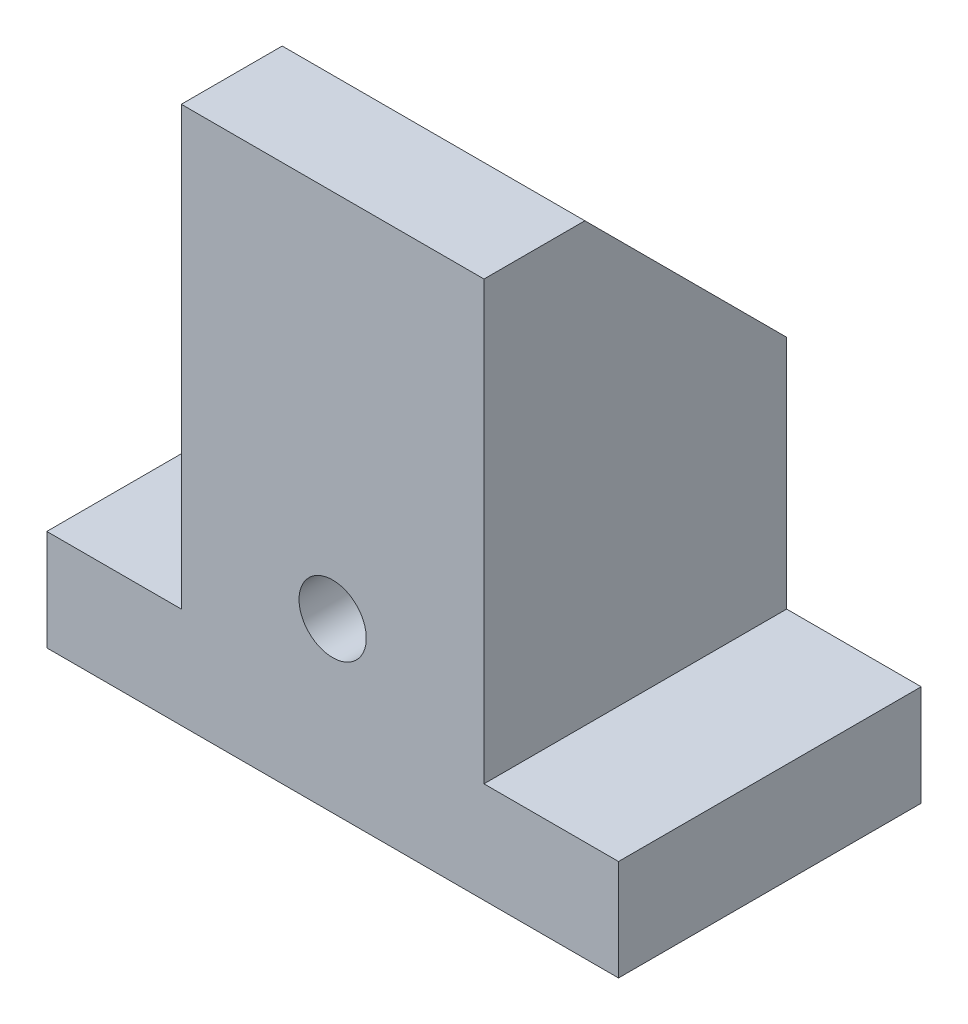
ISO-10303-21;
HEADER;
FILE_DESCRIPTION(('STEP AP214'),'2;1');
FILE_NAME('part.step','',(''),(''),'','','');
FILE_SCHEMA(('AUTOMOTIVE_DESIGN { 1 0 10303 214 1 1 1 1 }'));
ENDSEC;
DATA;
#1=APPLICATION_CONTEXT('core data for automotive mechanical design processes');
#2=APPLICATION_PROTOCOL_DEFINITION('international standard','automotive_design',2000,#1);
#3=PRODUCT_CONTEXT('',#1,'mechanical');
#4=PRODUCT('Part','Part','',(#3));
#5=PRODUCT_RELATED_PRODUCT_CATEGORY('part','',(#4));
#6=PRODUCT_DEFINITION_FORMATION('','',#4);
#7=PRODUCT_DEFINITION_CONTEXT('part definition',#1,'design');
#8=PRODUCT_DEFINITION('design','',#6,#7);
#9=PRODUCT_DEFINITION_SHAPE('','',#8);
#10=(LENGTH_UNIT() NAMED_UNIT(*) SI_UNIT(.MILLI.,.METRE.));
#11=(NAMED_UNIT(*) PLANE_ANGLE_UNIT() SI_UNIT($,.RADIAN.));
#12=(NAMED_UNIT(*) SI_UNIT($,.STERADIAN.) SOLID_ANGLE_UNIT());
#13=UNCERTAINTY_MEASURE_WITH_UNIT(LENGTH_MEASURE(1.E-05),#10,'distance_accuracy_value','');
#14=(GEOMETRIC_REPRESENTATION_CONTEXT(3) GLOBAL_UNCERTAINTY_ASSIGNED_CONTEXT((#13)) GLOBAL_UNIT_ASSIGNED_CONTEXT((#10,
#11,#12)) REPRESENTATION_CONTEXT('',''));
#15=CARTESIAN_POINT('',(0.,0.,0.));
#16=DIRECTION('',(0.,0.,1.));
#17=DIRECTION('',(1.,0.,0.));
#18=AXIS2_PLACEMENT_3D('',#15,#16,#17);
#19=CARTESIAN_POINT('',(0.,16.,0.));
#20=DIRECTION('',(1.,0.,0.));
#21=DIRECTION('',(0.,0.,-1.));
#22=AXIS2_PLACEMENT_3D('',#19,#20,#21);
#23=PLANE('',#22);
#24=DIRECTION('',(0.,-1.,0.));
#25=VECTOR('',#24,1.);
#26=CARTESIAN_POINT('',(0.,16.,-9.));
#27=LINE('',#26,#25);
#28=CARTESIAN_POINT('',(0.,10.,-9.));
#29=VERTEX_POINT('',#28);
#30=CARTESIAN_POINT('',(0.,3.,-9.));
#31=VERTEX_POINT('',#30);
#32=EDGE_CURVE('E211',#29,#31,#27,.T.);
#33=ORIENTED_EDGE('',*,*,#32,.T.);
#34=DIRECTION('',(0.,0.,1.));
#35=VECTOR('',#34,1.);
#36=CARTESIAN_POINT('',(0.,3.,0.));
#37=LINE('',#36,#35);
#38=CARTESIAN_POINT('',(0.,3.,0.));
#39=VERTEX_POINT('',#38);
#40=EDGE_CURVE('E134',#31,#39,#37,.T.);
#41=ORIENTED_EDGE('',*,*,#40,.T.);
#42=DIRECTION('',(0.,-1.,0.));
#43=VECTOR('',#42,1.);
#44=CARTESIAN_POINT('',(0.,16.,0.));
#45=LINE('',#44,#43);
#46=CARTESIAN_POINT('',(0.,16.,0.));
#47=VERTEX_POINT('',#46);
#48=EDGE_CURVE('E145',#47,#39,#45,.T.);
#49=ORIENTED_EDGE('',*,*,#48,.F.);
#50=DIRECTION('',(0.,0.,1.));
#51=VECTOR('',#50,1.);
#52=CARTESIAN_POINT('',(0.,16.,0.));
#53=LINE('',#52,#51);
#54=CARTESIAN_POINT('',(0.,16.,-3.));
#55=VERTEX_POINT('',#54);
#56=EDGE_CURVE('E200',#55,#47,#53,.T.);
#57=ORIENTED_EDGE('',*,*,#56,.F.);
#58=DIRECTION('',(0.,0.707106781186548,0.707106781186548));
#59=VECTOR('',#58,1.);
#60=CARTESIAN_POINT('',(0.,16.,-3.));
#61=LINE('',#60,#59);
#62=EDGE_CURVE('E233',#55,#29,#61,.F.);
#63=ORIENTED_EDGE('',*,*,#62,.T.);
#64=EDGE_LOOP('',(#33,#41,#49,#57,#63));
#65=FACE_BOUND('',#64,.T.);
#66=ADVANCED_FACE('F43',(#65),#23,.F.);
#67=CARTESIAN_POINT('',(0.,16.,0.));
#68=DIRECTION('',(0.,0.,-1.));
#69=DIRECTION('',(-1.,0.,0.));
#70=AXIS2_PLACEMENT_3D('',#67,#68,#69);
#71=PLANE('',#70);
#72=CARTESIAN_POINT('',(4.5,5.,0.));
#73=DIRECTION('',(0.,0.,-1.));
#74=DIRECTION('',(-1.,0.,0.));
#75=AXIS2_PLACEMENT_3D('',#72,#73,#74);
#76=CIRCLE('',#75,1.);
#77=CARTESIAN_POINT('',(3.5,5.,0.));
#78=VERTEX_POINT('',#77);
#79=EDGE_CURVE('E186',#78,#78,#76,.F.);
#80=ORIENTED_EDGE('',*,*,#79,.F.);
#81=EDGE_LOOP('',(#80));
#82=FACE_BOUND('',#81,.T.);
#83=DIRECTION('',(1.,0.,0.));
#84=VECTOR('',#83,1.);
#85=CARTESIAN_POINT('',(0.,0.,0.));
#86=LINE('',#85,#84);
#87=CARTESIAN_POINT('',(-4.00000000000001,0.,0.));
#88=VERTEX_POINT('',#87);
#89=CARTESIAN_POINT('',(13.,0.,0.));
#90=VERTEX_POINT('',#89);
#91=EDGE_CURVE('E195',#88,#90,#86,.T.);
#92=ORIENTED_EDGE('',*,*,#91,.T.);
#93=DIRECTION('',(0.,-1.,0.));
#94=VECTOR('',#93,1.);
#95=CARTESIAN_POINT('',(13.,3.,0.));
#96=LINE('',#95,#94);
#97=CARTESIAN_POINT('',(13.,3.,0.));
#98=VERTEX_POINT('',#97);
#99=EDGE_CURVE('E175',#98,#90,#96,.T.);
#100=ORIENTED_EDGE('',*,*,#99,.F.);
#101=DIRECTION('',(-1.,0.,0.));
#102=VECTOR('',#101,1.);
#103=CARTESIAN_POINT('',(9.,3.,0.));
#104=LINE('',#103,#102);
#105=CARTESIAN_POINT('',(9.,3.,0.));
#106=VERTEX_POINT('',#105);
#107=EDGE_CURVE('E167',#98,#106,#104,.T.);
#108=ORIENTED_EDGE('',*,*,#107,.T.);
#109=DIRECTION('',(0.,-1.,0.));
#110=VECTOR('',#109,1.);
#111=CARTESIAN_POINT('',(9.,16.,0.));
#112=LINE('',#111,#110);
#113=CARTESIAN_POINT('',(9.,16.,0.));
#114=VERTEX_POINT('',#113);
#115=EDGE_CURVE('E223',#114,#106,#112,.T.);
#116=ORIENTED_EDGE('',*,*,#115,.F.);
#117=DIRECTION('',(1.,0.,0.));
#118=VECTOR('',#117,1.);
#119=CARTESIAN_POINT('',(0.,16.,0.));
#120=LINE('',#119,#118);
#121=EDGE_CURVE('E203',#47,#114,#120,.T.);
#122=ORIENTED_EDGE('',*,*,#121,.F.);
#123=ORIENTED_EDGE('',*,*,#48,.T.);
#124=DIRECTION('',(-1.,0.,0.));
#125=VECTOR('',#124,1.);
#126=CARTESIAN_POINT('',(0.,3.,0.));
#127=LINE('',#126,#125);
#128=CARTESIAN_POINT('',(-4.00000000000001,3.,0.));
#129=VERTEX_POINT('',#128);
#130=EDGE_CURVE('E66',#39,#129,#127,.T.);
#131=ORIENTED_EDGE('',*,*,#130,.T.);
#132=DIRECTION('',(0.,-1.,0.));
#133=VECTOR('',#132,1.);
#134=CARTESIAN_POINT('',(-4.00000000000001,3.,0.));
#135=LINE('',#134,#133);
#136=EDGE_CURVE('E125',#129,#88,#135,.T.);
#137=ORIENTED_EDGE('',*,*,#136,.T.);
#138=EDGE_LOOP('',(#92,#100,#108,#116,#122,#123,#131,#137));
#139=FACE_BOUND('',#138,.T.);
#140=ADVANCED_FACE('F142',(#82,#139),#71,.F.);
#141=CARTESIAN_POINT('',(9.,16.,0.));
#142=DIRECTION('',(-1.,0.,0.));
#143=DIRECTION('',(0.,0.,1.));
#144=AXIS2_PLACEMENT_3D('',#141,#142,#143);
#145=PLANE('',#144);
#146=ORIENTED_EDGE('',*,*,#115,.T.);
#147=DIRECTION('',(0.,0.,-1.));
#148=VECTOR('',#147,1.);
#149=CARTESIAN_POINT('',(9.,3.,0.));
#150=LINE('',#149,#148);
#151=CARTESIAN_POINT('',(9.,3.,-9.));
#152=VERTEX_POINT('',#151);
#153=EDGE_CURVE('E158',#106,#152,#150,.T.);
#154=ORIENTED_EDGE('',*,*,#153,.T.);
#155=DIRECTION('',(0.,-1.,0.));
#156=VECTOR('',#155,1.);
#157=CARTESIAN_POINT('',(9.,16.,-9.));
#158=LINE('',#157,#156);
#159=CARTESIAN_POINT('',(9.,10.,-9.));
#160=VERTEX_POINT('',#159);
#161=EDGE_CURVE('E219',#160,#152,#158,.T.);
#162=ORIENTED_EDGE('',*,*,#161,.F.);
#163=DIRECTION('',(0.,-0.707106781186548,-0.707106781186548));
#164=VECTOR('',#163,1.);
#165=CARTESIAN_POINT('',(9.,16.,-3.));
#166=LINE('',#165,#164);
#167=CARTESIAN_POINT('',(9.,16.,-3.));
#168=VERTEX_POINT('',#167);
#169=EDGE_CURVE('E13',#160,#168,#166,.F.);
#170=ORIENTED_EDGE('',*,*,#169,.T.);
#171=DIRECTION('',(0.,0.,-1.));
#172=VECTOR('',#171,1.);
#173=CARTESIAN_POINT('',(9.,16.,0.));
#174=LINE('',#173,#172);
#175=EDGE_CURVE('E207',#114,#168,#174,.T.);
#176=ORIENTED_EDGE('',*,*,#175,.F.);
#177=EDGE_LOOP('',(#146,#154,#162,#170,#176));
#178=FACE_BOUND('',#177,.T.);
#179=ADVANCED_FACE('F269',(#178),#145,.F.);
#180=CARTESIAN_POINT('',(0.,16.,-9.));
#181=DIRECTION('',(0.,0.,1.));
#182=DIRECTION('',(1.,0.,0.));
#183=AXIS2_PLACEMENT_3D('',#180,#181,#182);
#184=PLANE('',#183);
#185=CARTESIAN_POINT('',(4.5,5.,-9.));
#186=DIRECTION('',(0.,0.,-1.));
#187=DIRECTION('',(-1.,0.,0.));
#188=AXIS2_PLACEMENT_3D('',#185,#186,#187);
#189=CIRCLE('',#188,1.);
#190=CARTESIAN_POINT('',(3.5,5.,-9.));
#191=VERTEX_POINT('',#190);
#192=EDGE_CURVE('E179',#191,#191,#189,.T.);
#193=ORIENTED_EDGE('',*,*,#192,.F.);
#194=EDGE_LOOP('',(#193));
#195=FACE_BOUND('',#194,.T.);
#196=ORIENTED_EDGE('',*,*,#32,.F.);
#197=DIRECTION('',(1.,0.,0.));
#198=VECTOR('',#197,1.);
#199=CARTESIAN_POINT('',(0.,10.,-9.));
#200=LINE('',#199,#198);
#201=EDGE_CURVE('E58',#29,#160,#200,.T.);
#202=ORIENTED_EDGE('',*,*,#201,.T.);
#203=ORIENTED_EDGE('',*,*,#161,.T.);
#204=DIRECTION('',(1.,0.,0.));
#205=VECTOR('',#204,1.);
#206=CARTESIAN_POINT('',(9.,3.,-9.));
#207=LINE('',#206,#205);
#208=CARTESIAN_POINT('',(13.,3.,-9.));
#209=VERTEX_POINT('',#208);
#210=EDGE_CURVE('E74',#152,#209,#207,.T.);
#211=ORIENTED_EDGE('',*,*,#210,.T.);
#212=DIRECTION('',(0.,-1.,0.));
#213=VECTOR('',#212,1.);
#214=CARTESIAN_POINT('',(13.,3.,-9.));
#215=LINE('',#214,#213);
#216=CARTESIAN_POINT('',(13.,0.,-9.));
#217=VERTEX_POINT('',#216);
#218=EDGE_CURVE('E171',#209,#217,#215,.T.);
#219=ORIENTED_EDGE('',*,*,#218,.T.);
#220=DIRECTION('',(-1.,0.,0.));
#221=VECTOR('',#220,1.);
#222=CARTESIAN_POINT('',(0.,0.,-9.));
#223=LINE('',#222,#221);
#224=CARTESIAN_POINT('',(-4.,0.,-9.));
#225=VERTEX_POINT('',#224);
#226=EDGE_CURVE('E204',#217,#225,#223,.T.);
#227=ORIENTED_EDGE('',*,*,#226,.T.);
#228=DIRECTION('',(0.,-1.,0.));
#229=VECTOR('',#228,1.);
#230=CARTESIAN_POINT('',(-4.,3.,-9.));
#231=LINE('',#230,#229);
#232=CARTESIAN_POINT('',(-4.,3.,-9.));
#233=VERTEX_POINT('',#232);
#234=EDGE_CURVE('E133',#233,#225,#231,.T.);
#235=ORIENTED_EDGE('',*,*,#234,.F.);
#236=DIRECTION('',(1.,0.,0.));
#237=VECTOR('',#236,1.);
#238=CARTESIAN_POINT('',(0.,3.,-9.));
#239=LINE('',#238,#237);
#240=EDGE_CURVE('E138',#233,#31,#239,.T.);
#241=ORIENTED_EDGE('',*,*,#240,.T.);
#242=EDGE_LOOP('',(#196,#202,#203,#211,#219,#227,#235,#241));
#243=FACE_BOUND('',#242,.T.);
#244=ADVANCED_FACE('F275',(#195,#243),#184,.F.);
#245=CARTESIAN_POINT('',(0.,16.,0.));
#246=DIRECTION('',(0.,-1.,0.));
#247=DIRECTION('',(0.,0.,-1.));
#248=AXIS2_PLACEMENT_3D('',#245,#246,#247);
#249=PLANE('',#248);
#250=ORIENTED_EDGE('',*,*,#175,.T.);
#251=DIRECTION('',(-1.,0.,0.));
#252=VECTOR('',#251,1.);
#253=CARTESIAN_POINT('',(0.,16.,-3.));
#254=LINE('',#253,#252);
#255=EDGE_CURVE('E229',#168,#55,#254,.T.);
#256=ORIENTED_EDGE('',*,*,#255,.T.);
#257=ORIENTED_EDGE('',*,*,#56,.T.);
#258=ORIENTED_EDGE('',*,*,#121,.T.);
#259=EDGE_LOOP('',(#250,#256,#257,#258));
#260=FACE_BOUND('',#259,.T.);
#261=ADVANCED_FACE('F279',(#260),#249,.F.);
#262=CARTESIAN_POINT('',(0.,0.,0.));
#263=DIRECTION('',(0.,-1.,0.));
#264=DIRECTION('',(0.,0.,-1.));
#265=AXIS2_PLACEMENT_3D('',#262,#263,#264);
#266=PLANE('',#265);
#267=CARTESIAN_POINT('',(4.5,0.,-4.5));
#268=DIRECTION('',(0.,-1.,0.));
#269=DIRECTION('',(0.,0.,-1.));
#270=AXIS2_PLACEMENT_3D('',#267,#268,#269);
#271=CIRCLE('',#270,3.1);
#272=CARTESIAN_POINT('',(4.5,0.,-7.6));
#273=VERTEX_POINT('',#272);
#274=EDGE_CURVE('E196',#273,#273,#271,.T.);
#275=ORIENTED_EDGE('',*,*,#274,.F.);
#276=EDGE_LOOP('',(#275));
#277=FACE_BOUND('',#276,.T.);
#278=ORIENTED_EDGE('',*,*,#91,.F.);
#279=DIRECTION('',(0.,0.,-1.));
#280=VECTOR('',#279,1.);
#281=CARTESIAN_POINT('',(-4.00000000000001,0.,0.));
#282=LINE('',#281,#280);
#283=EDGE_CURVE('E130',#88,#225,#282,.T.);
#284=ORIENTED_EDGE('',*,*,#283,.T.);
#285=ORIENTED_EDGE('',*,*,#226,.F.);
#286=DIRECTION('',(0.,0.,1.));
#287=VECTOR('',#286,1.);
#288=CARTESIAN_POINT('',(13.,0.,0.));
#289=LINE('',#288,#287);
#290=EDGE_CURVE('E156',#217,#90,#289,.T.);
#291=ORIENTED_EDGE('',*,*,#290,.T.);
#292=EDGE_LOOP('',(#278,#284,#285,#291));
#293=FACE_BOUND('',#292,.T.);
#294=ADVANCED_FACE('F281',(#277,#293),#266,.T.);
#295=CARTESIAN_POINT('',(0.,16.,-3.));
#296=DIRECTION('',(0.,-0.707106781186548,0.707106781186548));
#297=DIRECTION('',(-1.,0.,0.));
#298=AXIS2_PLACEMENT_3D('',#295,#296,#297);
#299=PLANE('',#298);
#300=ORIENTED_EDGE('',*,*,#169,.F.);
#301=ORIENTED_EDGE('',*,*,#201,.F.);
#302=ORIENTED_EDGE('',*,*,#62,.F.);
#303=ORIENTED_EDGE('',*,*,#255,.F.);
#304=EDGE_LOOP('',(#300,#301,#302,#303));
#305=FACE_BOUND('',#304,.T.);
#306=ADVANCED_FACE('F45',(#305),#299,.F.);
#307=CARTESIAN_POINT('',(4.5,8.,-4.5));
#308=DIRECTION('',(0.,-1.,0.));
#309=DIRECTION('',(0.,0.,-1.));
#310=AXIS2_PLACEMENT_3D('',#307,#308,#309);
#311=CYLINDRICAL_SURFACE('',#310,3.1);
#312=CARTESIAN_POINT('',(4.5,6.,-7.6));
#313=CARTESIAN_POINT('',(4.55466169283785,5.9999999220244,-7.59999991732933));
#314=CARTESIAN_POINT('',(4.60932462602791,5.99550346640278,-7.59854074383551));
#315=CARTESIAN_POINT('',(4.71704639473119,5.97768733967546,-7.59286313233695));
#316=CARTESIAN_POINT('',(4.7701049601658,5.96436619157606,-7.58864423243674));
#317=CARTESIAN_POINT('',(4.87304927098199,5.92940059437505,-7.57790688090447));
#318=CARTESIAN_POINT('',(4.92293996666465,5.90776952345547,-7.57139212676488));
#319=CARTESIAN_POINT('',(5.01838580555784,5.85685672340504,-7.55673203907304));
#320=CARTESIAN_POINT('',(5.06394017936532,5.82757364000014,-7.54858641694504));
#321=CARTESIAN_POINT('',(5.1509091612487,5.76118172182863,-7.53122795920094));
#322=CARTESIAN_POINT('',(5.19216230567085,5.72386778188202,-7.52199075558346));
#323=CARTESIAN_POINT('',(5.26794699676576,5.64290975132731,-7.50362795341575));
#324=CARTESIAN_POINT('',(5.30247718593358,5.59926438537053,-7.49450237775344));
#325=CARTESIAN_POINT('',(5.36473316101155,5.50545810364635,-7.47713144725325));
#326=CARTESIAN_POINT('',(5.39225335045706,5.45515467487142,-7.4689159896008));
#327=CARTESIAN_POINT('',(5.43837531947987,5.35032572472668,-7.4546638972052));
#328=CARTESIAN_POINT('',(5.45697962441289,5.29580140398039,-7.44862664562182));
#329=CARTESIAN_POINT('',(5.48414378042732,5.18590732742383,-7.43967022252739));
#330=CARTESIAN_POINT('',(5.49300462017844,5.13061978282441,-7.43665788132408));
#331=CARTESIAN_POINT('',(5.50137095885894,5.01926701054254,-7.43381620930014));
#332=CARTESIAN_POINT('',(5.50087913430537,4.96320200993948,-7.43398596783569));
#333=CARTESIAN_POINT('',(5.49078869758625,4.85441188027401,-7.43740735589061));
#334=CARTESIAN_POINT('',(5.48157748381759,4.80164599191764,-7.44052787811318));
#335=CARTESIAN_POINT('',(5.45493969434589,4.69845279895776,-7.44928546572062));
#336=CARTESIAN_POINT('',(5.43751219317275,4.64802575850151,-7.45492281459322));
#337=CARTESIAN_POINT('',(5.39467256082217,4.5500392599599,-7.46817595683684));
#338=CARTESIAN_POINT('',(5.3691420734998,4.50253564078958,-7.47582076641868));
#339=CARTESIAN_POINT('',(5.31090335738701,4.41236189812341,-7.49221470175116));
#340=CARTESIAN_POINT('',(5.27819316296051,4.36969310314947,-7.50096412964128));
#341=CARTESIAN_POINT('',(5.2046418185161,4.28821630882477,-7.51910259490866));
#342=CARTESIAN_POINT('',(5.16348231379142,4.24969745541927,-7.5285020322448));
#343=CARTESIAN_POINT('',(5.07517149003537,4.18003608493673,-7.54650716560178));
#344=CARTESIAN_POINT('',(5.02801966752911,4.14889418830244,-7.55511279482185));
#345=CARTESIAN_POINT('',(4.92847881216302,4.09465744086115,-7.57066150642765));
#346=CARTESIAN_POINT('',(4.87604745470778,4.07163559847724,-7.57758933782193));
#347=CARTESIAN_POINT('',(4.76778000843475,4.03482639045741,-7.5888915225951));
#348=CARTESIAN_POINT('',(4.71194503056773,4.02103602906435,-7.59326670428871));
#349=CARTESIAN_POINT('',(4.60090652781824,4.00358315794135,-7.59883546017117));
#350=CARTESIAN_POINT('',(4.54577054395812,3.99952956516814,-7.60015181896368));
#351=CARTESIAN_POINT('',(4.43559801533602,4.00055721927925,-7.59982018660884));
#352=CARTESIAN_POINT('',(4.38056145633741,4.00563703390178,-7.59817266024525));
#353=CARTESIAN_POINT('',(4.27368557266407,4.0244754132811,-7.5921792527875));
#354=CARTESIAN_POINT('',(4.22180009259947,4.03799777632602,-7.58790685930159));
#355=CARTESIAN_POINT('',(4.12105177075712,4.07304581158147,-7.57716867368517));
#356=CARTESIAN_POINT('',(4.07218930976771,4.09457248965462,-7.57070260589543));
#357=CARTESIAN_POINT('',(3.9774956560774,4.14562548497316,-7.55603411703274));
#358=CARTESIAN_POINT('',(3.93177263296912,4.1753406677613,-7.54779185335867));
#359=CARTESIAN_POINT('',(3.84583265337167,4.24170286885525,-7.53050981454519));
#360=CARTESIAN_POINT('',(3.80561728738405,4.27835188226725,-7.52146981026828));
#361=CARTESIAN_POINT('',(3.73006232725588,4.35938124752915,-7.50312715409018));
#362=CARTESIAN_POINT('',(3.69500169842739,4.4040234857309,-7.49382961373558));
#363=CARTESIAN_POINT('',(3.632839915567,4.49875897334226,-7.47642049261311));
#364=CARTESIAN_POINT('',(3.60573871904891,4.54885219365343,-7.46830890551493));
#365=CARTESIAN_POINT('',(3.56041522019475,4.6530195807189,-7.45427571684034));
#366=CARTESIAN_POINT('',(3.54216568753211,4.70708094179586,-7.44834741256436));
#367=CARTESIAN_POINT('',(3.51510247306238,4.81774224623256,-7.43941897363931));
#368=CARTESIAN_POINT('',(3.50628489171471,4.87434113038817,-7.43641762891512));
#369=CARTESIAN_POINT('',(3.49862767722396,4.98553895185141,-7.43381458815353));
#370=CARTESIAN_POINT('',(3.49932788531524,5.04010290467727,-7.43405610172574));
#371=CARTESIAN_POINT('',(3.50956519992378,5.14829362936697,-7.43752743878588));
#372=CARTESIAN_POINT('',(3.51910184196903,5.20192045033859,-7.44075710520666));
#373=CARTESIAN_POINT('',(3.5464246325665,5.30583238116483,-7.44972779399559));
#374=CARTESIAN_POINT('',(3.56407086561138,5.35615824895085,-7.45542613218533));
#375=CARTESIAN_POINT('',(3.60700035375674,5.45317451079793,-7.4686788226802));
#376=CARTESIAN_POINT('',(3.63228523276323,5.49986412916846,-7.476233569577));
#377=CARTESIAN_POINT('',(3.69099444078142,5.59037149180946,-7.49273704950311));
#378=CARTESIAN_POINT('',(3.72471183706028,5.63399094946717,-7.50173047270294));
#379=CARTESIAN_POINT('',(3.7988229837281,5.71510155114981,-7.51990141354045));
#380=CARTESIAN_POINT('',(3.83921856739663,5.75259100674495,-7.52907898111945));
#381=CARTESIAN_POINT('',(3.92726868795232,5.82171838592172,-7.54697636303769));
#382=CARTESIAN_POINT('',(3.975130499722,5.8531003814197,-7.5556682369196));
#383=CARTESIAN_POINT('',(4.07572907189011,5.90733491952482,-7.57125043822646));
#384=CARTESIAN_POINT('',(4.12846422250271,5.93019026622078,-7.57814135769285));
#385=CARTESIAN_POINT('',(4.23374449989671,5.96539312404397,-7.58896778011839));
#386=CARTESIAN_POINT('',(4.28607534816249,5.97833137754337,-7.59306744505299));
#387=CARTESIAN_POINT('',(4.39227063895625,5.9956338442161,-7.59858327970547));
#388=CARTESIAN_POINT('',(4.44613471724206,6.00000007683951,-7.60000008146617));
#389=CARTESIAN_POINT('',(4.5,6.,-7.6));
#390=B_SPLINE_CURVE_WITH_KNOTS('',3,(#312,#313,#314,#315,#316,#317,#318,#319,#320,#321,#322,
#323,#324,#325,#326,#327,#328,#329,#330,#331,#332,#333,#334,#335,#336,#337,#338,#339,#340,#341,
#342,#343,#344,#345,#346,#347,#348,#349,#350,#351,#352,#353,#354,#355,#356,#357,#358,#359,#360,
#361,#362,#363,#364,#365,#366,#367,#368,#369,#370,#371,#372,#373,#374,#375,#376,#377,#378,#379,
#380,#381,#382,#383,#384,#385,#386,#387,#388,#389),.UNSPECIFIED.,.T.,.F.,(4,2,2,2,2,2,2,2,2,2,2,
2,2,2,2,2,2,2,2,2,2,2,2,2,2,2,2,2,2,2,2,2,2,2,2,2,2,2,4),(0.,0.163786977571215,
0.327601375188354,0.491153145030707,0.654733880339088,0.823132982457992,0.991566052684571,
1.16448270045612,1.33735034192779,1.50471321360198,1.672028190599,1.83224194543619,
1.99247375081972,2.15516292888894,2.31789670313387,2.48855415146277,2.6592259479318,
2.83139534275185,3.00350883884293,3.16858437380869,3.33363402459453,3.4942610328502,
3.65490823313219,3.81962570567674,3.98439064549244,4.15614032639134,4.32788909050078,
4.49910609991183,4.67025229406716,4.83315473478929,4.99604861330971,5.15623187832753,
5.31644922082922,5.48328449671261,5.65016564808849,5.82298974464348,5.99575695575451,
6.15719562667168,6.31859626029482),.UNSPECIFIED.);
#391=CARTESIAN_POINT('',(4.5,6.,-7.6));
#392=VERTEX_POINT('',#391);
#393=EDGE_CURVE('E47',#392,#392,#390,.T.);
#394=ORIENTED_EDGE('',*,*,#393,.T.);
#395=EDGE_LOOP('',(#394));
#396=FACE_BOUND('',#395,.T.);
#397=CARTESIAN_POINT('',(3.5,5.,-1.56571984977576));
#398=CARTESIAN_POINT('',(3.50000008393222,4.94542190483951,-1.56571973974939));
#399=CARTESIAN_POINT('',(3.50448329466555,4.89084257084123,-1.56418045314144));
#400=CARTESIAN_POINT('',(3.52224203887663,4.7832938206581,-1.55821909161907));
#401=CARTESIAN_POINT('',(3.5355194969404,4.73032475952955,-1.55379638568313));
#402=CARTESIAN_POINT('',(3.57035750936549,4.6275708168718,-1.54262011804665));
#403=CARTESIAN_POINT('',(3.59190266138299,4.5777802140008,-1.53587089291111));
#404=CARTESIAN_POINT('',(3.64261248731658,4.48250533976337,-1.5208082139011));
#405=CARTESIAN_POINT('',(3.67177867097799,4.43702192409652,-1.51249445017907));
#406=CARTESIAN_POINT('',(3.73804662039264,4.34998690669601,-1.49489798175696));
#407=CARTESIAN_POINT('',(3.775379851286,4.30861615096276,-1.48559226142342));
#408=CARTESIAN_POINT('',(3.85642747338047,4.23260051922729,-1.4672556152598));
#409=CARTESIAN_POINT('',(3.90014281601883,4.19795664785797,-1.45822473064487));
#410=CARTESIAN_POINT('',(3.9940242309549,4.13556945871346,-1.44119049338578));
#411=CARTESIAN_POINT('',(4.04432106499651,4.10801392921971,-1.43321738228398));
#412=CARTESIAN_POINT('',(4.14913679323276,4.06182493725669,-1.41946696152845));
#413=CARTESIAN_POINT('',(4.20365462208739,4.04318923197929,-1.41368909997474));
#414=CARTESIAN_POINT('',(4.31346998702327,4.01597720853031,-1.40514314955061));
#415=CARTESIAN_POINT('',(4.36868352534317,4.00709145661001,-1.40228269465521));
#416=CARTESIAN_POINT('',(4.47988699362059,3.99864950478037,-1.39956684624086));
#417=CARTESIAN_POINT('',(4.53587673258651,3.99909104913425,-1.39971072614592));
#418=CARTESIAN_POINT('',(4.64485954021232,4.0090910678201,-1.40292384090052));
#419=CARTESIAN_POINT('',(4.69788710612328,4.01831379448766,-1.40588534121509));
#420=CARTESIAN_POINT('',(4.80159706579454,4.04506141942007,-1.41426712324415));
#421=CARTESIAN_POINT('',(4.8522793032458,4.06258687016413,-1.41968756858055));
#422=CARTESIAN_POINT('',(4.9506152018646,4.10564870958558,-1.4325192611374));
#423=CARTESIAN_POINT('',(4.99822226445784,4.1312839423249,-1.4399549005809));
#424=CARTESIAN_POINT('',(5.08856091829528,4.18975735818887,-1.45603802900847));
#425=CARTESIAN_POINT('',(5.13129121183324,4.22259745176185,-1.46468583919294));
#426=CARTESIAN_POINT('',(5.21266331671049,4.29625710447005,-1.4827287931781));
#427=CARTESIAN_POINT('',(5.25104045340647,4.33736551047165,-1.49214007332987));
#428=CARTESIAN_POINT('',(5.32043829755909,4.42551908045938,-1.5103225540283));
#429=CARTESIAN_POINT('',(5.35145801600792,4.4725650412899,-1.51909366841224));
#430=CARTESIAN_POINT('',(5.4055958935917,4.57204915925237,-1.53508748386544));
#431=CARTESIAN_POINT('',(5.42860956437008,4.62454779098786,-1.5422892816059));
#432=CARTESIAN_POINT('',(5.46538352792603,4.73296472384489,-1.55408554608901));
#433=CARTESIAN_POINT('',(5.47914740628849,4.78888169070392,-1.5586810230366));
#434=CARTESIAN_POINT('',(5.49650704883291,4.89999870104457,-1.56451801185102));
#435=CARTESIAN_POINT('',(5.50051054691129,4.95512801172935,-1.56589391486691));
#436=CARTESIAN_POINT('',(5.49938536260691,5.0652766803609,-1.56551031178732));
#437=CARTESIAN_POINT('',(5.49425820669253,5.12029605514737,-1.56375132978382));
#438=CARTESIAN_POINT('',(5.47538261971221,5.22686080693343,-1.55742945809404));
#439=CARTESIAN_POINT('',(5.46191047995171,5.2784610214779,-1.5529565174874));
#440=CARTESIAN_POINT('',(5.42705513208207,5.37866066966982,-1.54180776161741));
#441=CARTESIAN_POINT('',(5.40567057903701,5.42725959152391,-1.53513157187112));
#442=CARTESIAN_POINT('',(5.35486291413187,5.52170003835174,-1.52007892163399));
#443=CARTESIAN_POINT('',(5.3252168421399,5.56741421942897,-1.5116572597451));
#444=CARTESIAN_POINT('',(5.25898431124997,5.65336696753216,-1.49415332844885));
#445=CARTESIAN_POINT('',(5.22239593271502,5.69360401476262,-1.4850708767539));
#446=CARTESIAN_POINT('',(5.14137817256809,5.76931291378532,-1.46677873012206));
#447=CARTESIAN_POINT('',(5.09667190028672,5.80449226915494,-1.45758142092841));
#448=CARTESIAN_POINT('',(5.00176610305983,5.86686465050271,-1.44049806554781));
#449=CARTESIAN_POINT('',(4.95156680606356,5.89405800771103,-1.43261196498259));
#450=CARTESIAN_POINT('',(4.84738378936584,5.93942995932992,-1.41908110319035));
#451=CARTESIAN_POINT('',(4.79342944927608,5.95767114871906,-1.41342083562172));
#452=CARTESIAN_POINT('',(4.68300221747729,5.98475333336416,-1.40491168134641));
#453=CARTESIAN_POINT('',(4.62653017774576,5.99359748375065,-1.40206185103619));
#454=CARTESIAN_POINT('',(4.51535471306858,6.00136490141175,-1.39956136160609));
#455=CARTESIAN_POINT('',(4.46068343728813,6.00070938181826,-1.39977487040801));
#456=CARTESIAN_POINT('',(4.3522658163928,5.99052441117792,-1.40304738335717));
#457=CARTESIAN_POINT('',(4.29851940439828,5.98099560455447,-1.406106180865));
#458=CARTESIAN_POINT('',(4.19422526022036,5.95360837819609,-1.41467926681608));
#459=CARTESIAN_POINT('',(4.14364315977675,5.93586905644971,-1.4201583968398));
#460=CARTESIAN_POINT('',(4.04615097767774,5.89267311172299,-1.43300774647766));
#461=CARTESIAN_POINT('',(3.99924154588007,5.86721512683493,-1.44037829978581));
#462=CARTESIAN_POINT('',(3.90861689293609,5.80826401558397,-1.45657086511751));
#463=CARTESIAN_POINT('',(3.86507363460369,5.77451824988266,-1.46543503695159));
#464=CARTESIAN_POINT('',(3.78412912484707,5.70038744736922,-1.48350333578034));
#465=CARTESIAN_POINT('',(3.74672977647893,5.66000036115182,-1.49270756703001));
#466=CARTESIAN_POINT('',(3.67777239177273,5.57199412715744,-1.51080943536483));
#467=CARTESIAN_POINT('',(3.64647284739331,5.52416710107395,-1.51968413645097));
#468=CARTESIAN_POINT('',(3.59238439563589,5.42365998823091,-1.5357068611999));
#469=CARTESIAN_POINT('',(3.5695926122878,5.37098154896778,-1.54285546806381));
#470=CARTESIAN_POINT('',(3.53449853910887,5.26584182840457,-1.55413419741988));
#471=CARTESIAN_POINT('',(3.52160165034919,5.2135971019703,-1.5584328368892));
#472=CARTESIAN_POINT('',(3.50435357983733,5.10756835041436,-1.56422531016941));
#473=CARTESIAN_POINT('',(3.49999991728777,5.05378477674986,-1.56571995820283));
#474=CARTESIAN_POINT('',(3.5,5.,-1.56571984977576));
#475=B_SPLINE_CURVE_WITH_KNOTS('',3,(#397,#398,#399,#400,#401,#402,#403,#404,#405,#406,#407,
#408,#409,#410,#411,#412,#413,#414,#415,#416,#417,#418,#419,#420,#421,#422,#423,#424,#425,#426,
#427,#428,#429,#430,#431,#432,#433,#434,#435,#436,#437,#438,#439,#440,#441,#442,#443,#444,#445,
#446,#447,#448,#449,#450,#451,#452,#453,#454,#455,#456,#457,#458,#459,#460,#461,#462,#463,#464,
#465,#466,#467,#468,#469,#470,#471,#472,#473,#474),.UNSPECIFIED.,.T.,.F.,(4,2,2,2,2,2,2,2,2,2,2,
2,2,2,2,2,2,2,2,2,2,2,2,2,2,2,2,2,2,2,2,2,2,2,2,2,2,2,4),(0.,0.163535372497496,
0.327106545890617,0.490374461381496,0.653674745206163,0.822400735240238,0.991151904468057,
1.16399680566172,1.33679822372726,1.50394084931689,1.67104305317661,1.83200234879244,
1.99297235645362,2.15598523285829,2.31904138628018,2.48931465395979,2.65961079736373,
2.83205275098968,3.00442782068651,3.16946832782984,3.33448124598925,3.49430301491825,
3.65415196251588,3.81882122331062,3.98353608380452,4.15559586229854,4.3276485033703,
4.4984803487322,4.66925481780129,4.83248127239041,4.99569587356546,5.15661378024038,
5.31756009636897,5.4842064495646,5.65090432399359,5.8235981482136,5.99623354189985,
6.15743866842514,6.31859697698499),.UNSPECIFIED.);
#476=CARTESIAN_POINT('',(3.5,5.,-1.56571984977576));
#477=VERTEX_POINT('',#476);
#478=EDGE_CURVE('E190',#477,#477,#475,.T.);
#479=ORIENTED_EDGE('',*,*,#478,.T.);
#480=EDGE_LOOP('',(#479));
#481=FACE_BOUND('',#480,.T.);
#482=CARTESIAN_POINT('',(4.5,8.,-4.5));
#483=DIRECTION('',(0.,-1.,0.));
#484=DIRECTION('',(0.,0.,-1.));
#485=AXIS2_PLACEMENT_3D('',#482,#483,#484);
#486=CIRCLE('',#485,3.1);
#487=CARTESIAN_POINT('',(4.5,8.,-7.6));
#488=VERTEX_POINT('',#487);
#489=EDGE_CURVE('E191',#488,#488,#486,.T.);
#490=ORIENTED_EDGE('',*,*,#489,.F.);
#491=EDGE_LOOP('',(#490));
#492=FACE_BOUND('',#491,.T.);
#493=ORIENTED_EDGE('',*,*,#274,.T.);
#494=EDGE_LOOP('',(#493));
#495=FACE_BOUND('',#494,.T.);
#496=ADVANCED_FACE('F242',(#396,#481,#492,#495),#311,.F.);
#497=CARTESIAN_POINT('',(4.5,8.,-4.5));
#498=DIRECTION('',(0.,-1.,0.));
#499=DIRECTION('',(0.,0.,-1.));
#500=AXIS2_PLACEMENT_3D('',#497,#498,#499);
#501=PLANE('',#500);
#502=ORIENTED_EDGE('',*,*,#489,.T.);
#503=EDGE_LOOP('',(#502));
#504=FACE_BOUND('',#503,.T.);
#505=ADVANCED_FACE('F254',(#504),#501,.T.);
#506=CARTESIAN_POINT('',(4.5,5.,2.82842712474619));
#507=DIRECTION('',(0.,0.,-1.));
#508=DIRECTION('',(-1.,0.,0.));
#509=AXIS2_PLACEMENT_3D('',#506,#507,#508);
#510=CYLINDRICAL_SURFACE('',#509,1.);
#511=ORIENTED_EDGE('',*,*,#79,.T.);
#512=EDGE_LOOP('',(#511));
#513=FACE_BOUND('',#512,.T.);
#514=ORIENTED_EDGE('',*,*,#478,.F.);
#515=EDGE_LOOP('',(#514));
#516=FACE_BOUND('',#515,.T.);
#517=ADVANCED_FACE('F251',(#513,#516),#510,.F.);
#518=ORIENTED_EDGE('',*,*,#192,.T.);
#519=EDGE_LOOP('',(#518));
#520=FACE_BOUND('',#519,.T.);
#521=ORIENTED_EDGE('',*,*,#393,.F.);
#522=EDGE_LOOP('',(#521));
#523=FACE_BOUND('',#522,.T.);
#524=ADVANCED_FACE('F246',(#520,#523),#510,.F.);
#525=CARTESIAN_POINT('',(13.,3.,0.));
#526=DIRECTION('',(1.,0.,0.));
#527=DIRECTION('',(0.,0.,-1.));
#528=AXIS2_PLACEMENT_3D('',#525,#526,#527);
#529=PLANE('',#528);
#530=ORIENTED_EDGE('',*,*,#290,.F.);
#531=ORIENTED_EDGE('',*,*,#218,.F.);
#532=DIRECTION('',(0.,0.,1.));
#533=VECTOR('',#532,1.);
#534=CARTESIAN_POINT('',(13.,3.,0.));
#535=LINE('',#534,#533);
#536=EDGE_CURVE('E163',#209,#98,#535,.T.);
#537=ORIENTED_EDGE('',*,*,#536,.T.);
#538=ORIENTED_EDGE('',*,*,#99,.T.);
#539=EDGE_LOOP('',(#530,#531,#537,#538));
#540=FACE_BOUND('',#539,.T.);
#541=ADVANCED_FACE('F250',(#540),#529,.T.);
#542=CARTESIAN_POINT('',(0.,3.,0.));
#543=DIRECTION('',(0.,-1.,0.));
#544=DIRECTION('',(0.,0.,-1.));
#545=AXIS2_PLACEMENT_3D('',#542,#543,#544);
#546=PLANE('',#545);
#547=ORIENTED_EDGE('',*,*,#153,.F.);
#548=ORIENTED_EDGE('',*,*,#107,.F.);
#549=ORIENTED_EDGE('',*,*,#536,.F.);
#550=ORIENTED_EDGE('',*,*,#210,.F.);
#551=EDGE_LOOP('',(#547,#548,#549,#550));
#552=FACE_BOUND('',#551,.T.);
#553=ADVANCED_FACE('F302',(#552),#546,.F.);
#554=CARTESIAN_POINT('',(-4.00000000000001,3.,0.));
#555=DIRECTION('',(-1.,0.,0.));
#556=DIRECTION('',(0.,0.,1.));
#557=AXIS2_PLACEMENT_3D('',#554,#555,#556);
#558=PLANE('',#557);
#559=ORIENTED_EDGE('',*,*,#283,.F.);
#560=ORIENTED_EDGE('',*,*,#136,.F.);
#561=DIRECTION('',(0.,0.,-1.));
#562=VECTOR('',#561,1.);
#563=CARTESIAN_POINT('',(-4.00000000000001,3.,0.));
#564=LINE('',#563,#562);
#565=EDGE_CURVE('E128',#129,#233,#564,.T.);
#566=ORIENTED_EDGE('',*,*,#565,.T.);
#567=ORIENTED_EDGE('',*,*,#234,.T.);
#568=EDGE_LOOP('',(#559,#560,#566,#567));
#569=FACE_BOUND('',#568,.T.);
#570=ADVANCED_FACE('F126',(#569),#558,.T.);
#571=CARTESIAN_POINT('',(0.,3.,0.));
#572=DIRECTION('',(0.,-1.,0.));
#573=DIRECTION('',(0.,0.,-1.));
#574=AXIS2_PLACEMENT_3D('',#571,#572,#573);
#575=PLANE('',#574);
#576=ORIENTED_EDGE('',*,*,#130,.F.);
#577=ORIENTED_EDGE('',*,*,#40,.F.);
#578=ORIENTED_EDGE('',*,*,#240,.F.);
#579=ORIENTED_EDGE('',*,*,#565,.F.);
#580=EDGE_LOOP('',(#576,#577,#578,#579));
#581=FACE_BOUND('',#580,.T.);
#582=ADVANCED_FACE('F137',(#581),#575,.F.);
#583=CLOSED_SHELL('',(#66,#140,#179,#244,#261,#294,#306,#496,#505,#517,#524,#541,#553,#570,#582));
#584=MANIFOLD_SOLID_BREP('B2',#583);
#585=ADVANCED_BREP_SHAPE_REPRESENTATION('',(#18,#584),#14);
#586=SHAPE_DEFINITION_REPRESENTATION(#9,#585);
ENDSEC;
END-ISO-10303-21;
